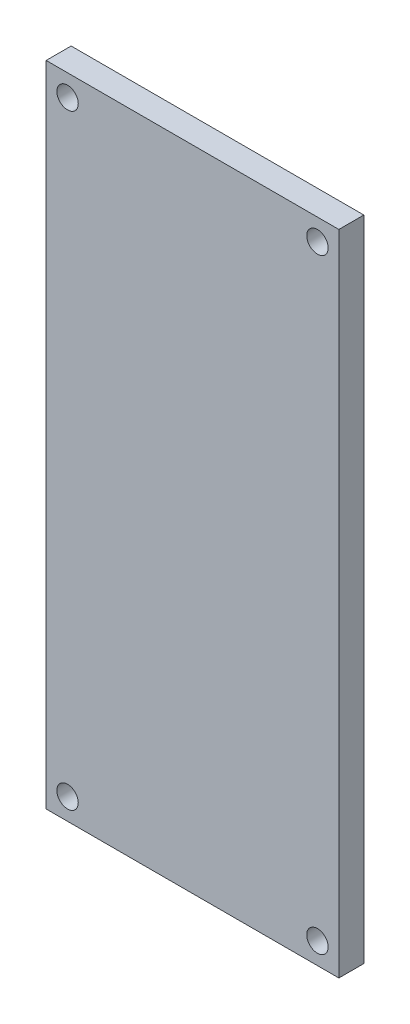
ISO-10303-21;
HEADER;
FILE_DESCRIPTION(('STEP AP214'),'2;1');
FILE_NAME('part.step','',(''),(''),'','','');
FILE_SCHEMA(('AUTOMOTIVE_DESIGN { 1 0 10303 214 1 1 1 1 }'));
ENDSEC;
DATA;
#1=APPLICATION_CONTEXT('core data for automotive mechanical design processes');
#2=APPLICATION_PROTOCOL_DEFINITION('international standard','automotive_design',2000,#1);
#3=PRODUCT_CONTEXT('',#1,'mechanical');
#4=PRODUCT('Part','Part','',(#3));
#5=PRODUCT_RELATED_PRODUCT_CATEGORY('part','',(#4));
#6=PRODUCT_DEFINITION_FORMATION('','',#4);
#7=PRODUCT_DEFINITION_CONTEXT('part definition',#1,'design');
#8=PRODUCT_DEFINITION('design','',#6,#7);
#9=PRODUCT_DEFINITION_SHAPE('','',#8);
#10=(LENGTH_UNIT() NAMED_UNIT(*) SI_UNIT(.MILLI.,.METRE.));
#11=(NAMED_UNIT(*) PLANE_ANGLE_UNIT() SI_UNIT($,.RADIAN.));
#12=(NAMED_UNIT(*) SI_UNIT($,.STERADIAN.) SOLID_ANGLE_UNIT());
#13=UNCERTAINTY_MEASURE_WITH_UNIT(LENGTH_MEASURE(1.E-05),#10,'distance_accuracy_value','');
#14=(GEOMETRIC_REPRESENTATION_CONTEXT(3) GLOBAL_UNCERTAINTY_ASSIGNED_CONTEXT((#13)) GLOBAL_UNIT_ASSIGNED_CONTEXT((#10,
#11,#12)) REPRESENTATION_CONTEXT('',''));
#15=CARTESIAN_POINT('',(0.,0.,0.));
#16=DIRECTION('',(0.,0.,1.));
#17=DIRECTION('',(1.,0.,0.));
#18=AXIS2_PLACEMENT_3D('',#15,#16,#17);
#19=CARTESIAN_POINT('',(-10.25,22.7,1.75));
#20=DIRECTION('',(1.,0.,0.));
#21=DIRECTION('',(0.,0.,-1.));
#22=AXIS2_PLACEMENT_3D('',#19,#20,#21);
#23=PLANE('',#22);
#24=DIRECTION('',(0.,-1.,0.));
#25=VECTOR('',#24,1.);
#26=CARTESIAN_POINT('',(-10.25,22.7,0.));
#27=LINE('',#26,#25);
#28=CARTESIAN_POINT('',(-10.25,22.7,0.));
#29=VERTEX_POINT('',#28);
#30=CARTESIAN_POINT('',(-10.25,-22.7,0.));
#31=VERTEX_POINT('',#30);
#32=EDGE_CURVE('E109',#29,#31,#27,.T.);
#33=ORIENTED_EDGE('',*,*,#32,.T.);
#34=DIRECTION('',(0.,0.,-1.));
#35=VECTOR('',#34,1.);
#36=CARTESIAN_POINT('',(-10.25,-22.7,1.75));
#37=LINE('',#36,#35);
#38=CARTESIAN_POINT('',(-10.25,-22.7,1.75));
#39=VERTEX_POINT('',#38);
#40=EDGE_CURVE('E11',#39,#31,#37,.T.);
#41=ORIENTED_EDGE('',*,*,#40,.F.);
#42=DIRECTION('',(0.,-1.,0.));
#43=VECTOR('',#42,1.);
#44=CARTESIAN_POINT('',(-10.25,22.7,1.75));
#45=LINE('',#44,#43);
#46=CARTESIAN_POINT('',(-10.25,22.7,1.75));
#47=VERTEX_POINT('',#46);
#48=EDGE_CURVE('E93',#47,#39,#45,.T.);
#49=ORIENTED_EDGE('',*,*,#48,.F.);
#50=DIRECTION('',(0.,0.,-1.));
#51=VECTOR('',#50,1.);
#52=CARTESIAN_POINT('',(-10.25,22.7,1.75));
#53=LINE('',#52,#51);
#54=EDGE_CURVE('E105',#47,#29,#53,.T.);
#55=ORIENTED_EDGE('',*,*,#54,.T.);
#56=EDGE_LOOP('',(#33,#41,#49,#55));
#57=FACE_BOUND('',#56,.T.);
#58=ADVANCED_FACE('F41',(#57),#23,.F.);
#59=CARTESIAN_POINT('',(-10.25,-22.7,1.75));
#60=DIRECTION('',(0.,1.,0.));
#61=DIRECTION('',(0.,0.,1.));
#62=AXIS2_PLACEMENT_3D('',#59,#60,#61);
#63=PLANE('',#62);
#64=DIRECTION('',(1.,0.,0.));
#65=VECTOR('',#64,1.);
#66=CARTESIAN_POINT('',(-10.25,-22.7,0.));
#67=LINE('',#66,#65);
#68=CARTESIAN_POINT('',(10.25,-22.7,0.));
#69=VERTEX_POINT('',#68);
#70=EDGE_CURVE('E98',#31,#69,#67,.T.);
#71=ORIENTED_EDGE('',*,*,#70,.T.);
#72=DIRECTION('',(0.,0.,-1.));
#73=VECTOR('',#72,1.);
#74=CARTESIAN_POINT('',(10.25,-22.7,1.75));
#75=LINE('',#74,#73);
#76=CARTESIAN_POINT('',(10.25,-22.7,1.75));
#77=VERTEX_POINT('',#76);
#78=EDGE_CURVE('E50',#77,#69,#75,.T.);
#79=ORIENTED_EDGE('',*,*,#78,.F.);
#80=DIRECTION('',(1.,0.,0.));
#81=VECTOR('',#80,1.);
#82=CARTESIAN_POINT('',(-10.25,-22.7,1.75));
#83=LINE('',#82,#81);
#84=EDGE_CURVE('E88',#39,#77,#83,.T.);
#85=ORIENTED_EDGE('',*,*,#84,.F.);
#86=ORIENTED_EDGE('',*,*,#40,.T.);
#87=EDGE_LOOP('',(#71,#79,#85,#86));
#88=FACE_BOUND('',#87,.T.);
#89=ADVANCED_FACE('F97',(#88),#63,.F.);
#90=CARTESIAN_POINT('',(10.25,22.7,1.75));
#91=DIRECTION('',(-1.,0.,0.));
#92=DIRECTION('',(0.,0.,1.));
#93=AXIS2_PLACEMENT_3D('',#90,#91,#92);
#94=PLANE('',#93);
#95=DIRECTION('',(0.,1.,0.));
#96=VECTOR('',#95,1.);
#97=CARTESIAN_POINT('',(10.25,22.7,0.));
#98=LINE('',#97,#96);
#99=CARTESIAN_POINT('',(10.25,22.7,0.));
#100=VERTEX_POINT('',#99);
#101=EDGE_CURVE('E75',#69,#100,#98,.T.);
#102=ORIENTED_EDGE('',*,*,#101,.T.);
#103=DIRECTION('',(0.,0.,-1.));
#104=VECTOR('',#103,1.);
#105=CARTESIAN_POINT('',(10.25,22.7,1.75));
#106=LINE('',#105,#104);
#107=CARTESIAN_POINT('',(10.25,22.7,1.75));
#108=VERTEX_POINT('',#107);
#109=EDGE_CURVE('E100',#108,#100,#106,.T.);
#110=ORIENTED_EDGE('',*,*,#109,.F.);
#111=DIRECTION('',(0.,1.,0.));
#112=VECTOR('',#111,1.);
#113=CARTESIAN_POINT('',(10.25,22.7,1.75));
#114=LINE('',#113,#112);
#115=EDGE_CURVE('E91',#77,#108,#114,.T.);
#116=ORIENTED_EDGE('',*,*,#115,.F.);
#117=ORIENTED_EDGE('',*,*,#78,.T.);
#118=EDGE_LOOP('',(#102,#110,#116,#117));
#119=FACE_BOUND('',#118,.T.);
#120=ADVANCED_FACE('F101',(#119),#94,.F.);
#121=CARTESIAN_POINT('',(-10.25,22.7,1.75));
#122=DIRECTION('',(0.,-1.,0.));
#123=DIRECTION('',(0.,0.,-1.));
#124=AXIS2_PLACEMENT_3D('',#121,#122,#123);
#125=PLANE('',#124);
#126=DIRECTION('',(-1.,0.,0.));
#127=VECTOR('',#126,1.);
#128=CARTESIAN_POINT('',(-10.25,22.7,0.));
#129=LINE('',#128,#127);
#130=EDGE_CURVE('E81',#100,#29,#129,.T.);
#131=ORIENTED_EDGE('',*,*,#130,.T.);
#132=ORIENTED_EDGE('',*,*,#54,.F.);
#133=DIRECTION('',(-1.,0.,0.));
#134=VECTOR('',#133,1.);
#135=CARTESIAN_POINT('',(-10.25,22.7,1.75));
#136=LINE('',#135,#134);
#137=EDGE_CURVE('E58',#108,#47,#136,.T.);
#138=ORIENTED_EDGE('',*,*,#137,.F.);
#139=ORIENTED_EDGE('',*,*,#109,.T.);
#140=EDGE_LOOP('',(#131,#132,#138,#139));
#141=FACE_BOUND('',#140,.T.);
#142=ADVANCED_FACE('F123',(#141),#125,.F.);
#143=CARTESIAN_POINT('',(-10.25,-22.7,1.75));
#144=DIRECTION('',(0.,0.,1.));
#145=DIRECTION('',(1.,0.,0.));
#146=AXIS2_PLACEMENT_3D('',#143,#144,#145);
#147=PLANE('',#146);
#148=CARTESIAN_POINT('',(-8.75,21.2,1.75));
#149=DIRECTION('',(0.,0.,1.));
#150=DIRECTION('',(-1.,0.,0.));
#151=AXIS2_PLACEMENT_3D('',#148,#149,#150);
#152=CIRCLE('',#151,0.75);
#153=CARTESIAN_POINT('',(-9.5,21.2,1.75));
#154=VERTEX_POINT('',#153);
#155=EDGE_CURVE('E157',#154,#154,#152,.T.);
#156=ORIENTED_EDGE('',*,*,#155,.F.);
#157=EDGE_LOOP('',(#156));
#158=FACE_BOUND('',#157,.T.);
#159=CARTESIAN_POINT('',(8.75,21.2,1.75));
#160=DIRECTION('',(0.,0.,-1.));
#161=DIRECTION('',(1.,0.,0.));
#162=AXIS2_PLACEMENT_3D('',#159,#160,#161);
#163=CIRCLE('',#162,0.75);
#164=CARTESIAN_POINT('',(9.5,21.2,1.75));
#165=VERTEX_POINT('',#164);
#166=EDGE_CURVE('E149',#165,#165,#163,.T.);
#167=ORIENTED_EDGE('',*,*,#166,.T.);
#168=EDGE_LOOP('',(#167));
#169=FACE_BOUND('',#168,.T.);
#170=CARTESIAN_POINT('',(-8.75,-21.2,1.75));
#171=DIRECTION('',(0.,0.,-1.));
#172=DIRECTION('',(-1.,0.,0.));
#173=AXIS2_PLACEMENT_3D('',#170,#171,#172);
#174=CIRCLE('',#173,0.75);
#175=CARTESIAN_POINT('',(-9.5,-21.2,1.75));
#176=VERTEX_POINT('',#175);
#177=EDGE_CURVE('E141',#176,#176,#174,.T.);
#178=ORIENTED_EDGE('',*,*,#177,.T.);
#179=EDGE_LOOP('',(#178));
#180=FACE_BOUND('',#179,.T.);
#181=CARTESIAN_POINT('',(8.75,-21.2,1.75));
#182=DIRECTION('',(0.,0.,1.));
#183=DIRECTION('',(1.,0.,0.));
#184=AXIS2_PLACEMENT_3D('',#181,#182,#183);
#185=CIRCLE('',#184,0.75);
#186=CARTESIAN_POINT('',(9.5,-21.2,1.75));
#187=VERTEX_POINT('',#186);
#188=EDGE_CURVE('E133',#187,#187,#185,.T.);
#189=ORIENTED_EDGE('',*,*,#188,.F.);
#190=EDGE_LOOP('',(#189));
#191=FACE_BOUND('',#190,.T.);
#192=ORIENTED_EDGE('',*,*,#48,.T.);
#193=ORIENTED_EDGE('',*,*,#84,.T.);
#194=ORIENTED_EDGE('',*,*,#115,.T.);
#195=ORIENTED_EDGE('',*,*,#137,.T.);
#196=EDGE_LOOP('',(#192,#193,#194,#195));
#197=FACE_BOUND('',#196,.T.);
#198=ADVANCED_FACE('F89',(#158,#169,#180,#191,#197),#147,.T.);
#199=CARTESIAN_POINT('',(-10.25,-22.7,0.));
#200=DIRECTION('',(0.,0.,1.));
#201=DIRECTION('',(1.,0.,0.));
#202=AXIS2_PLACEMENT_3D('',#199,#200,#201);
#203=PLANE('',#202);
#204=CARTESIAN_POINT('',(-8.75,21.2,0.));
#205=DIRECTION('',(0.,0.,1.));
#206=DIRECTION('',(1.,0.,0.));
#207=AXIS2_PLACEMENT_3D('',#204,#205,#206);
#208=CIRCLE('',#207,0.75);
#209=CARTESIAN_POINT('',(-8.,21.2,0.));
#210=VERTEX_POINT('',#209);
#211=EDGE_CURVE('E153',#210,#210,#208,.F.);
#212=ORIENTED_EDGE('',*,*,#211,.F.);
#213=EDGE_LOOP('',(#212));
#214=FACE_BOUND('',#213,.T.);
#215=CARTESIAN_POINT('',(8.75,21.2,0.));
#216=DIRECTION('',(0.,0.,1.));
#217=DIRECTION('',(1.,0.,0.));
#218=AXIS2_PLACEMENT_3D('',#215,#216,#217);
#219=CIRCLE('',#218,0.75);
#220=CARTESIAN_POINT('',(9.5,21.2,0.));
#221=VERTEX_POINT('',#220);
#222=EDGE_CURVE('E145',#221,#221,#219,.T.);
#223=ORIENTED_EDGE('',*,*,#222,.T.);
#224=EDGE_LOOP('',(#223));
#225=FACE_BOUND('',#224,.T.);
#226=CARTESIAN_POINT('',(-8.75,-21.2,0.));
#227=DIRECTION('',(0.,0.,1.));
#228=DIRECTION('',(1.,0.,0.));
#229=AXIS2_PLACEMENT_3D('',#226,#227,#228);
#230=CIRCLE('',#229,0.75);
#231=CARTESIAN_POINT('',(-8.,-21.2,0.));
#232=VERTEX_POINT('',#231);
#233=EDGE_CURVE('E137',#232,#232,#230,.T.);
#234=ORIENTED_EDGE('',*,*,#233,.T.);
#235=EDGE_LOOP('',(#234));
#236=FACE_BOUND('',#235,.T.);
#237=CARTESIAN_POINT('',(8.75,-21.2,0.));
#238=DIRECTION('',(0.,0.,1.));
#239=DIRECTION('',(1.,0.,0.));
#240=AXIS2_PLACEMENT_3D('',#237,#238,#239);
#241=CIRCLE('',#240,0.75);
#242=CARTESIAN_POINT('',(9.5,-21.2,0.));
#243=VERTEX_POINT('',#242);
#244=EDGE_CURVE('E113',#243,#243,#241,.F.);
#245=ORIENTED_EDGE('',*,*,#244,.F.);
#246=EDGE_LOOP('',(#245));
#247=FACE_BOUND('',#246,.T.);
#248=ORIENTED_EDGE('',*,*,#32,.F.);
#249=ORIENTED_EDGE('',*,*,#130,.F.);
#250=ORIENTED_EDGE('',*,*,#101,.F.);
#251=ORIENTED_EDGE('',*,*,#70,.F.);
#252=EDGE_LOOP('',(#248,#249,#250,#251));
#253=FACE_BOUND('',#252,.T.);
#254=ADVANCED_FACE('F126',(#214,#225,#236,#247,#253),#203,.F.);
#255=CARTESIAN_POINT('',(8.75,-21.2,-2.12132034355964));
#256=DIRECTION('',(0.,0.,1.));
#257=DIRECTION('',(1.,0.,0.));
#258=AXIS2_PLACEMENT_3D('',#255,#256,#257);
#259=CYLINDRICAL_SURFACE('',#258,0.75);
#260=ORIENTED_EDGE('',*,*,#244,.T.);
#261=EDGE_LOOP('',(#260));
#262=FACE_BOUND('',#261,.T.);
#263=ORIENTED_EDGE('',*,*,#188,.T.);
#264=EDGE_LOOP('',(#263));
#265=FACE_BOUND('',#264,.T.);
#266=ADVANCED_FACE('F173',(#262,#265),#259,.F.);
#267=CARTESIAN_POINT('',(-8.75,-21.2,-2.12132034355964));
#268=DIRECTION('',(0.,0.,1.));
#269=DIRECTION('',(1.,0.,0.));
#270=AXIS2_PLACEMENT_3D('',#267,#268,#269);
#271=CYLINDRICAL_SURFACE('',#270,0.75);
#272=ORIENTED_EDGE('',*,*,#233,.F.);
#273=EDGE_LOOP('',(#272));
#274=FACE_BOUND('',#273,.T.);
#275=ORIENTED_EDGE('',*,*,#177,.F.);
#276=EDGE_LOOP('',(#275));
#277=FACE_BOUND('',#276,.T.);
#278=ADVANCED_FACE('F175',(#274,#277),#271,.F.);
#279=CARTESIAN_POINT('',(8.75,21.2,-2.12132034355964));
#280=DIRECTION('',(0.,0.,1.));
#281=DIRECTION('',(1.,0.,0.));
#282=AXIS2_PLACEMENT_3D('',#279,#280,#281);
#283=CYLINDRICAL_SURFACE('',#282,0.75);
#284=ORIENTED_EDGE('',*,*,#222,.F.);
#285=EDGE_LOOP('',(#284));
#286=FACE_BOUND('',#285,.T.);
#287=ORIENTED_EDGE('',*,*,#166,.F.);
#288=EDGE_LOOP('',(#287));
#289=FACE_BOUND('',#288,.T.);
#290=ADVANCED_FACE('F182',(#286,#289),#283,.F.);
#291=CARTESIAN_POINT('',(-8.75,21.2,-2.12132034355964));
#292=DIRECTION('',(0.,0.,1.));
#293=DIRECTION('',(1.,0.,0.));
#294=AXIS2_PLACEMENT_3D('',#291,#292,#293);
#295=CYLINDRICAL_SURFACE('',#294,0.75);
#296=ORIENTED_EDGE('',*,*,#211,.T.);
#297=EDGE_LOOP('',(#296));
#298=FACE_BOUND('',#297,.T.);
#299=ORIENTED_EDGE('',*,*,#155,.T.);
#300=EDGE_LOOP('',(#299));
#301=FACE_BOUND('',#300,.T.);
#302=ADVANCED_FACE('F162',(#298,#301),#295,.F.);
#303=CLOSED_SHELL('',(#58,#89,#120,#142,#198,#254,#266,#278,#290,#302));
#304=MANIFOLD_SOLID_BREP('B2',#303);
#305=ADVANCED_BREP_SHAPE_REPRESENTATION('',(#18,#304),#14);
#306=SHAPE_DEFINITION_REPRESENTATION(#9,#305);
ENDSEC;
END-ISO-10303-21;
